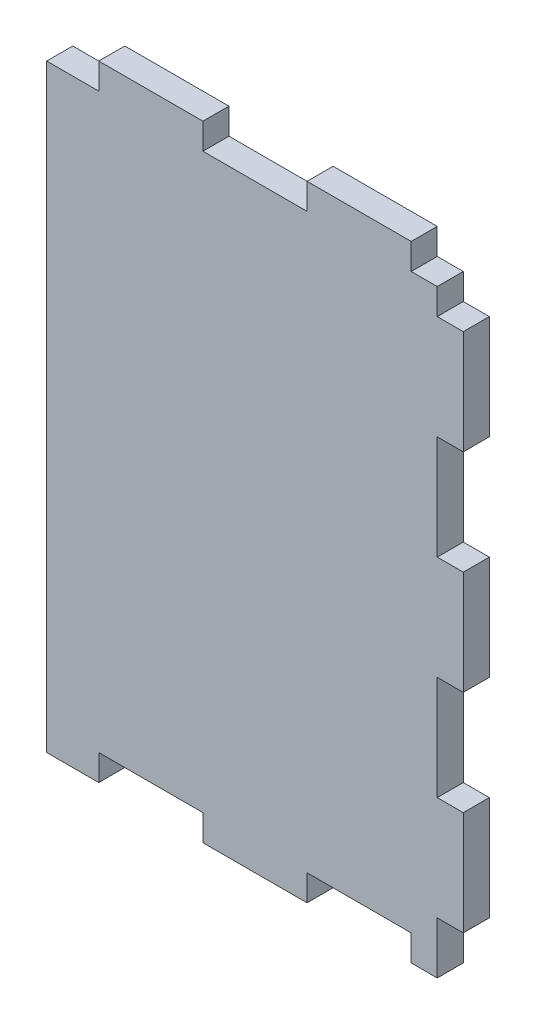
ISO-10303-21;
HEADER;
FILE_DESCRIPTION(('STEP AP214'),'2;1');
FILE_NAME('part.step','',(''),(''),'','','');
FILE_SCHEMA(('AUTOMOTIVE_DESIGN { 1 0 10303 214 1 1 1 1 }'));
ENDSEC;
DATA;
#1=APPLICATION_CONTEXT('core data for automotive mechanical design processes');
#2=APPLICATION_PROTOCOL_DEFINITION('international standard','automotive_design',2000,#1);
#3=PRODUCT_CONTEXT('',#1,'mechanical');
#4=PRODUCT('Part','Part','',(#3));
#5=PRODUCT_RELATED_PRODUCT_CATEGORY('part','',(#4));
#6=PRODUCT_DEFINITION_FORMATION('','',#4);
#7=PRODUCT_DEFINITION_CONTEXT('part definition',#1,'design');
#8=PRODUCT_DEFINITION('design','',#6,#7);
#9=PRODUCT_DEFINITION_SHAPE('','',#8);
#10=(LENGTH_UNIT() NAMED_UNIT(*) SI_UNIT(.MILLI.,.METRE.));
#11=(NAMED_UNIT(*) PLANE_ANGLE_UNIT() SI_UNIT($,.RADIAN.));
#12=(NAMED_UNIT(*) SI_UNIT($,.STERADIAN.) SOLID_ANGLE_UNIT());
#13=UNCERTAINTY_MEASURE_WITH_UNIT(LENGTH_MEASURE(1.E-05),#10,'distance_accuracy_value','');
#14=(GEOMETRIC_REPRESENTATION_CONTEXT(3) GLOBAL_UNCERTAINTY_ASSIGNED_CONTEXT((#13)) GLOBAL_UNIT_ASSIGNED_CONTEXT((#10,
#11,#12)) REPRESENTATION_CONTEXT('',''));
#15=CARTESIAN_POINT('',(0.,0.,0.));
#16=DIRECTION('',(0.,0.,1.));
#17=DIRECTION('',(1.,0.,0.));
#18=AXIS2_PLACEMENT_3D('',#15,#16,#17);
#19=CARTESIAN_POINT('',(0.,76.2,3.175));
#20=DIRECTION('',(0.,-1.,0.));
#21=DIRECTION('',(0.,0.,-1.));
#22=AXIS2_PLACEMENT_3D('',#19,#20,#21);
#23=PLANE('',#22);
#24=DIRECTION('',(-1.,0.,0.));
#25=VECTOR('',#24,1.);
#26=CARTESIAN_POINT('',(0.,76.2,3.175));
#27=LINE('',#26,#25);
#28=CARTESIAN_POINT('',(19.05,76.2,3.175));
#29=VERTEX_POINT('',#28);
#30=CARTESIAN_POINT('',(6.35,76.2,3.175));
#31=VERTEX_POINT('',#30);
#32=EDGE_CURVE('E459',#29,#31,#27,.T.);
#33=ORIENTED_EDGE('',*,*,#32,.F.);
#34=DIRECTION('',(0.,0.,1.));
#35=VECTOR('',#34,1.);
#36=CARTESIAN_POINT('',(19.05,76.2,0.));
#37=LINE('',#36,#35);
#38=CARTESIAN_POINT('',(19.05,76.2,0.));
#39=VERTEX_POINT('',#38);
#40=EDGE_CURVE('E269',#39,#29,#37,.T.);
#41=ORIENTED_EDGE('',*,*,#40,.F.);
#42=DIRECTION('',(-1.,0.,0.));
#43=VECTOR('',#42,1.);
#44=CARTESIAN_POINT('',(0.,76.2,0.));
#45=LINE('',#44,#43);
#46=CARTESIAN_POINT('',(6.35,76.2,0.));
#47=VERTEX_POINT('',#46);
#48=EDGE_CURVE('E260',#39,#47,#45,.T.);
#49=ORIENTED_EDGE('',*,*,#48,.T.);
#50=DIRECTION('',(0.,0.,1.));
#51=VECTOR('',#50,1.);
#52=CARTESIAN_POINT('',(6.35,76.2,0.));
#53=LINE('',#52,#51);
#54=EDGE_CURVE('E326',#47,#31,#53,.T.);
#55=ORIENTED_EDGE('',*,*,#54,.T.);
#56=EDGE_LOOP('',(#33,#41,#49,#55));
#57=FACE_BOUND('',#56,.T.);
#58=ADVANCED_FACE('F31',(#57),#23,.F.);
#59=CARTESIAN_POINT('',(0.,0.,3.175));
#60=DIRECTION('',(0.,1.,0.));
#61=DIRECTION('',(0.,0.,1.));
#62=AXIS2_PLACEMENT_3D('',#59,#60,#61);
#63=PLANE('',#62);
#64=DIRECTION('',(1.,0.,0.));
#65=VECTOR('',#64,1.);
#66=CARTESIAN_POINT('',(0.,0.,3.175));
#67=LINE('',#66,#65);
#68=CARTESIAN_POINT('',(44.45,0.,3.175));
#69=VERTEX_POINT('',#68);
#70=CARTESIAN_POINT('',(47.625,0.,3.175));
#71=VERTEX_POINT('',#70);
#72=EDGE_CURVE('E449',#69,#71,#67,.T.);
#73=ORIENTED_EDGE('',*,*,#72,.F.);
#74=DIRECTION('',(0.,0.,1.));
#75=VECTOR('',#74,1.);
#76=CARTESIAN_POINT('',(44.45,0.,0.));
#77=LINE('',#76,#75);
#78=CARTESIAN_POINT('',(44.45,0.,0.));
#79=VERTEX_POINT('',#78);
#80=EDGE_CURVE('E291',#79,#69,#77,.T.);
#81=ORIENTED_EDGE('',*,*,#80,.F.);
#82=DIRECTION('',(1.,0.,0.));
#83=VECTOR('',#82,1.);
#84=CARTESIAN_POINT('',(0.,0.,0.));
#85=LINE('',#84,#83);
#86=CARTESIAN_POINT('',(47.625,0.,0.));
#87=VERTEX_POINT('',#86);
#88=EDGE_CURVE('E465',#79,#87,#85,.T.);
#89=ORIENTED_EDGE('',*,*,#88,.T.);
#90=DIRECTION('',(0.,0.,1.));
#91=VECTOR('',#90,1.);
#92=CARTESIAN_POINT('',(47.625,0.,0.));
#93=LINE('',#92,#91);
#94=EDGE_CURVE('E424',#87,#71,#93,.T.);
#95=ORIENTED_EDGE('',*,*,#94,.T.);
#96=EDGE_LOOP('',(#73,#81,#89,#95));
#97=FACE_BOUND('',#96,.T.);
#98=ADVANCED_FACE('F580',(#97),#63,.F.);
#99=CARTESIAN_POINT('',(19.05,0.,0.));
#100=VERTEX_POINT('',#99);
#101=CARTESIAN_POINT('',(31.75,0.,0.));
#102=VERTEX_POINT('',#101);
#103=EDGE_CURVE('E470',#100,#102,#85,.T.);
#104=ORIENTED_EDGE('',*,*,#103,.T.);
#105=DIRECTION('',(0.,0.,1.));
#106=VECTOR('',#105,1.);
#107=CARTESIAN_POINT('',(31.75,0.,0.));
#108=LINE('',#107,#106);
#109=CARTESIAN_POINT('',(31.75,0.,3.175));
#110=VERTEX_POINT('',#109);
#111=EDGE_CURVE('E294',#102,#110,#108,.T.);
#112=ORIENTED_EDGE('',*,*,#111,.T.);
#113=CARTESIAN_POINT('',(19.05,0.,3.175));
#114=VERTEX_POINT('',#113);
#115=EDGE_CURVE('E455',#114,#110,#67,.T.);
#116=ORIENTED_EDGE('',*,*,#115,.F.);
#117=DIRECTION('',(0.,0.,1.));
#118=VECTOR('',#117,1.);
#119=CARTESIAN_POINT('',(19.05,0.,0.));
#120=LINE('',#119,#118);
#121=EDGE_CURVE('E350',#100,#114,#120,.T.);
#122=ORIENTED_EDGE('',*,*,#121,.F.);
#123=EDGE_LOOP('',(#104,#112,#116,#122));
#124=FACE_BOUND('',#123,.T.);
#125=ADVANCED_FACE('F586',(#124),#63,.F.);
#126=CARTESIAN_POINT('',(50.8,0.,3.175));
#127=DIRECTION('',(-1.,0.,0.));
#128=DIRECTION('',(0.,0.,1.));
#129=AXIS2_PLACEMENT_3D('',#126,#127,#128);
#130=PLANE('',#129);
#131=DIRECTION('',(0.,1.,0.));
#132=VECTOR('',#131,1.);
#133=CARTESIAN_POINT('',(50.8,0.,0.));
#134=LINE('',#133,#132);
#135=CARTESIAN_POINT('',(50.8,6.35000000000001,0.));
#136=VERTEX_POINT('',#135);
#137=CARTESIAN_POINT('',(50.8,19.05,0.));
#138=VERTEX_POINT('',#137);
#139=EDGE_CURVE('E471',#136,#138,#134,.T.);
#140=ORIENTED_EDGE('',*,*,#139,.T.);
#141=DIRECTION('',(0.,0.,1.));
#142=VECTOR('',#141,1.);
#143=CARTESIAN_POINT('',(50.8,19.05,0.));
#144=LINE('',#143,#142);
#145=CARTESIAN_POINT('',(50.8,19.05,3.175));
#146=VERTEX_POINT('',#145);
#147=EDGE_CURVE('E376',#138,#146,#144,.T.);
#148=ORIENTED_EDGE('',*,*,#147,.T.);
#149=DIRECTION('',(0.,1.,0.));
#150=VECTOR('',#149,1.);
#151=CARTESIAN_POINT('',(50.8,0.,3.175));
#152=LINE('',#151,#150);
#153=CARTESIAN_POINT('',(50.8,6.35000000000001,3.175));
#154=VERTEX_POINT('',#153);
#155=EDGE_CURVE('E456',#154,#146,#152,.T.);
#156=ORIENTED_EDGE('',*,*,#155,.F.);
#157=DIRECTION('',(0.,0.,1.));
#158=VECTOR('',#157,1.);
#159=CARTESIAN_POINT('',(50.8,6.35000000000001,0.));
#160=LINE('',#159,#158);
#161=EDGE_CURVE('E419',#136,#154,#160,.T.);
#162=ORIENTED_EDGE('',*,*,#161,.F.);
#163=EDGE_LOOP('',(#140,#148,#156,#162));
#164=FACE_BOUND('',#163,.T.);
#165=ADVANCED_FACE('F567',(#164),#130,.F.);
#166=CARTESIAN_POINT('',(50.8,31.75,3.175));
#167=VERTEX_POINT('',#166);
#168=CARTESIAN_POINT('',(50.8,44.45,3.175));
#169=VERTEX_POINT('',#168);
#170=EDGE_CURVE('E460',#167,#169,#152,.T.);
#171=ORIENTED_EDGE('',*,*,#170,.F.);
#172=DIRECTION('',(0.,0.,1.));
#173=VECTOR('',#172,1.);
#174=CARTESIAN_POINT('',(50.8,31.75,0.));
#175=LINE('',#174,#173);
#176=CARTESIAN_POINT('',(50.8,31.75,0.));
#177=VERTEX_POINT('',#176);
#178=EDGE_CURVE('E369',#177,#167,#175,.T.);
#179=ORIENTED_EDGE('',*,*,#178,.F.);
#180=CARTESIAN_POINT('',(50.8,44.45,0.));
#181=VERTEX_POINT('',#180);
#182=EDGE_CURVE('E474',#177,#181,#134,.T.);
#183=ORIENTED_EDGE('',*,*,#182,.T.);
#184=DIRECTION('',(0.,0.,1.));
#185=VECTOR('',#184,1.);
#186=CARTESIAN_POINT('',(50.8,44.45,0.));
#187=LINE('',#186,#185);
#188=EDGE_CURVE('E403',#181,#169,#187,.T.);
#189=ORIENTED_EDGE('',*,*,#188,.T.);
#190=EDGE_LOOP('',(#171,#179,#183,#189));
#191=FACE_BOUND('',#190,.T.);
#192=ADVANCED_FACE('F542',(#191),#130,.F.);
#193=CARTESIAN_POINT('',(0.,0.,3.175));
#194=DIRECTION('',(1.,0.,0.));
#195=DIRECTION('',(0.,0.,-1.));
#196=AXIS2_PLACEMENT_3D('',#193,#194,#195);
#197=PLANE('',#196);
#198=DIRECTION('',(0.,-1.,0.));
#199=VECTOR('',#198,1.);
#200=CARTESIAN_POINT('',(0.,0.,3.175));
#201=LINE('',#200,#199);
#202=CARTESIAN_POINT('',(0.,73.025,3.175));
#203=VERTEX_POINT('',#202);
#204=CARTESIAN_POINT('',(0.,0.,3.175));
#205=VERTEX_POINT('',#204);
#206=EDGE_CURVE('E447',#203,#205,#201,.T.);
#207=ORIENTED_EDGE('',*,*,#206,.F.);
#208=DIRECTION('',(0.,0.,1.));
#209=VECTOR('',#208,1.);
#210=CARTESIAN_POINT('',(0.,73.025,0.));
#211=LINE('',#210,#209);
#212=CARTESIAN_POINT('',(0.,73.025,0.));
#213=VERTEX_POINT('',#212);
#214=EDGE_CURVE('E321',#213,#203,#211,.T.);
#215=ORIENTED_EDGE('',*,*,#214,.F.);
#216=DIRECTION('',(0.,-1.,0.));
#217=VECTOR('',#216,1.);
#218=CARTESIAN_POINT('',(0.,0.,0.));
#219=LINE('',#218,#217);
#220=CARTESIAN_POINT('',(0.,0.,0.));
#221=VERTEX_POINT('',#220);
#222=EDGE_CURVE('E444',#213,#221,#219,.T.);
#223=ORIENTED_EDGE('',*,*,#222,.T.);
#224=DIRECTION('',(0.,0.,-1.));
#225=VECTOR('',#224,1.);
#226=CARTESIAN_POINT('',(0.,0.,3.175));
#227=LINE('',#226,#225);
#228=EDGE_CURVE('E39',#205,#221,#227,.T.);
#229=ORIENTED_EDGE('',*,*,#228,.F.);
#230=EDGE_LOOP('',(#207,#215,#223,#229));
#231=FACE_BOUND('',#230,.T.);
#232=ADVANCED_FACE('F33',(#231),#197,.F.);
#233=CARTESIAN_POINT('',(6.35,0.,0.));
#234=VERTEX_POINT('',#233);
#235=EDGE_CURVE('E466',#221,#234,#85,.T.);
#236=ORIENTED_EDGE('',*,*,#235,.T.);
#237=DIRECTION('',(0.,0.,1.));
#238=VECTOR('',#237,1.);
#239=CARTESIAN_POINT('',(6.35,0.,0.));
#240=LINE('',#239,#238);
#241=CARTESIAN_POINT('',(6.35,0.,3.175));
#242=VERTEX_POINT('',#241);
#243=EDGE_CURVE('E353',#234,#242,#240,.T.);
#244=ORIENTED_EDGE('',*,*,#243,.T.);
#245=EDGE_CURVE('E451',#205,#242,#67,.T.);
#246=ORIENTED_EDGE('',*,*,#245,.F.);
#247=ORIENTED_EDGE('',*,*,#228,.T.);
#248=EDGE_LOOP('',(#236,#244,#246,#247));
#249=FACE_BOUND('',#248,.T.);
#250=ADVANCED_FACE('F480',(#249),#63,.F.);
#251=CARTESIAN_POINT('',(50.8,57.15,3.175));
#252=VERTEX_POINT('',#251);
#253=CARTESIAN_POINT('',(50.8,69.85,3.175));
#254=VERTEX_POINT('',#253);
#255=EDGE_CURVE('E454',#252,#254,#152,.T.);
#256=ORIENTED_EDGE('',*,*,#255,.F.);
#257=DIRECTION('',(0.,0.,1.));
#258=VECTOR('',#257,1.);
#259=CARTESIAN_POINT('',(50.8,57.15,0.));
#260=LINE('',#259,#258);
#261=CARTESIAN_POINT('',(50.8,57.15,0.));
#262=VERTEX_POINT('',#261);
#263=EDGE_CURVE('E395',#262,#252,#260,.T.);
#264=ORIENTED_EDGE('',*,*,#263,.F.);
#265=CARTESIAN_POINT('',(50.8,69.85,0.));
#266=VERTEX_POINT('',#265);
#267=EDGE_CURVE('E469',#262,#266,#134,.T.);
#268=ORIENTED_EDGE('',*,*,#267,.T.);
#269=DIRECTION('',(0.,0.,1.));
#270=VECTOR('',#269,1.);
#271=CARTESIAN_POINT('',(50.8,69.85,0.));
#272=LINE('',#271,#270);
#273=EDGE_CURVE('E441',#266,#254,#272,.T.);
#274=ORIENTED_EDGE('',*,*,#273,.T.);
#275=EDGE_LOOP('',(#256,#264,#268,#274));
#276=FACE_BOUND('',#275,.T.);
#277=ADVANCED_FACE('F534',(#276),#130,.F.);
#278=CARTESIAN_POINT('',(44.45,76.2,0.));
#279=VERTEX_POINT('',#278);
#280=CARTESIAN_POINT('',(31.75,76.2,0.));
#281=VERTEX_POINT('',#280);
#282=EDGE_CURVE('E450',#279,#281,#45,.T.);
#283=ORIENTED_EDGE('',*,*,#282,.T.);
#284=DIRECTION('',(0.,0.,1.));
#285=VECTOR('',#284,1.);
#286=CARTESIAN_POINT('',(31.75,76.2,0.));
#287=LINE('',#286,#285);
#288=CARTESIAN_POINT('',(31.75,76.2,3.175));
#289=VERTEX_POINT('',#288);
#290=EDGE_CURVE('E272',#281,#289,#287,.T.);
#291=ORIENTED_EDGE('',*,*,#290,.T.);
#292=CARTESIAN_POINT('',(44.45,76.2,3.175));
#293=VERTEX_POINT('',#292);
#294=EDGE_CURVE('E461',#293,#289,#27,.T.);
#295=ORIENTED_EDGE('',*,*,#294,.F.);
#296=DIRECTION('',(0.,0.,1.));
#297=VECTOR('',#296,1.);
#298=CARTESIAN_POINT('',(44.45,76.2,0.));
#299=LINE('',#298,#297);
#300=EDGE_CURVE('E311',#279,#293,#299,.T.);
#301=ORIENTED_EDGE('',*,*,#300,.F.);
#302=EDGE_LOOP('',(#283,#291,#295,#301));
#303=FACE_BOUND('',#302,.T.);
#304=ADVANCED_FACE('F512',(#303),#23,.F.);
#305=CARTESIAN_POINT('',(0.,76.2,3.175));
#306=DIRECTION('',(0.,0.,-1.));
#307=DIRECTION('',(-1.,0.,0.));
#308=AXIS2_PLACEMENT_3D('',#305,#306,#307);
#309=PLANE('',#308);
#310=DIRECTION('',(1.,0.,0.));
#311=VECTOR('',#310,1.);
#312=CARTESIAN_POINT('',(19.05,73.025,3.175));
#313=LINE('',#312,#311);
#314=CARTESIAN_POINT('',(19.05,73.025,3.175));
#315=VERTEX_POINT('',#314);
#316=CARTESIAN_POINT('',(31.75,73.025,3.175));
#317=VERTEX_POINT('',#316);
#318=EDGE_CURVE('E263',#315,#317,#313,.T.);
#319=ORIENTED_EDGE('',*,*,#318,.F.);
#320=DIRECTION('',(0.,-1.,0.));
#321=VECTOR('',#320,1.);
#322=CARTESIAN_POINT('',(19.05,76.2,3.175));
#323=LINE('',#322,#321);
#324=EDGE_CURVE('E246',#29,#315,#323,.T.);
#325=ORIENTED_EDGE('',*,*,#324,.F.);
#326=ORIENTED_EDGE('',*,*,#32,.T.);
#327=DIRECTION('',(0.,1.,0.));
#328=VECTOR('',#327,1.);
#329=CARTESIAN_POINT('',(6.35,76.2,3.175));
#330=LINE('',#329,#328);
#331=CARTESIAN_POINT('',(6.35,73.025,3.175));
#332=VERTEX_POINT('',#331);
#333=EDGE_CURVE('E319',#332,#31,#330,.T.);
#334=ORIENTED_EDGE('',*,*,#333,.F.);
#335=DIRECTION('',(1.,0.,0.));
#336=VECTOR('',#335,1.);
#337=CARTESIAN_POINT('',(0.,73.025,3.175));
#338=LINE('',#337,#336);
#339=EDGE_CURVE('E313',#203,#332,#338,.T.);
#340=ORIENTED_EDGE('',*,*,#339,.F.);
#341=ORIENTED_EDGE('',*,*,#206,.T.);
#342=ORIENTED_EDGE('',*,*,#245,.T.);
#343=DIRECTION('',(0.,-1.,0.));
#344=VECTOR('',#343,1.);
#345=CARTESIAN_POINT('',(6.35,0.,3.175));
#346=LINE('',#345,#344);
#347=CARTESIAN_POINT('',(6.35,3.175,3.175));
#348=VERTEX_POINT('',#347);
#349=EDGE_CURVE('E337',#348,#242,#346,.T.);
#350=ORIENTED_EDGE('',*,*,#349,.F.);
#351=DIRECTION('',(-1.,0.,0.));
#352=VECTOR('',#351,1.);
#353=CARTESIAN_POINT('',(19.05,3.175,3.175));
#354=LINE('',#353,#352);
#355=CARTESIAN_POINT('',(19.05,3.175,3.175));
#356=VERTEX_POINT('',#355);
#357=EDGE_CURVE('E346',#356,#348,#354,.T.);
#358=ORIENTED_EDGE('',*,*,#357,.F.);
#359=DIRECTION('',(0.,1.,0.));
#360=VECTOR('',#359,1.);
#361=CARTESIAN_POINT('',(19.05,0.,3.175));
#362=LINE('',#361,#360);
#363=EDGE_CURVE('E329',#114,#356,#362,.T.);
#364=ORIENTED_EDGE('',*,*,#363,.F.);
#365=ORIENTED_EDGE('',*,*,#115,.T.);
#366=DIRECTION('',(0.,-1.,0.));
#367=VECTOR('',#366,1.);
#368=CARTESIAN_POINT('',(31.75,0.,3.175));
#369=LINE('',#368,#367);
#370=CARTESIAN_POINT('',(31.75,3.17500000000002,3.175));
#371=VERTEX_POINT('',#370);
#372=EDGE_CURVE('E280',#371,#110,#369,.T.);
#373=ORIENTED_EDGE('',*,*,#372,.F.);
#374=DIRECTION('',(-1.,0.,0.));
#375=VECTOR('',#374,1.);
#376=CARTESIAN_POINT('',(44.45,3.17500000000002,3.175));
#377=LINE('',#376,#375);
#378=CARTESIAN_POINT('',(44.45,3.17500000000002,3.175));
#379=VERTEX_POINT('',#378);
#380=EDGE_CURVE('E287',#379,#371,#377,.T.);
#381=ORIENTED_EDGE('',*,*,#380,.F.);
#382=DIRECTION('',(0.,1.,0.));
#383=VECTOR('',#382,1.);
#384=CARTESIAN_POINT('',(44.45,0.,3.175));
#385=LINE('',#384,#383);
#386=EDGE_CURVE('E271',#69,#379,#385,.T.);
#387=ORIENTED_EDGE('',*,*,#386,.F.);
#388=ORIENTED_EDGE('',*,*,#72,.T.);
#389=DIRECTION('',(0.,-1.,0.));
#390=VECTOR('',#389,1.);
#391=CARTESIAN_POINT('',(47.625,0.,3.175));
#392=LINE('',#391,#390);
#393=CARTESIAN_POINT('',(47.625,6.35000000000001,3.175));
#394=VERTEX_POINT('',#393);
#395=EDGE_CURVE('E416',#394,#71,#392,.T.);
#396=ORIENTED_EDGE('',*,*,#395,.F.);
#397=DIRECTION('',(-1.,0.,0.));
#398=VECTOR('',#397,1.);
#399=CARTESIAN_POINT('',(50.8,6.35000000000001,3.175));
#400=LINE('',#399,#398);
#401=EDGE_CURVE('E406',#154,#394,#400,.T.);
#402=ORIENTED_EDGE('',*,*,#401,.F.);
#403=ORIENTED_EDGE('',*,*,#155,.T.);
#404=DIRECTION('',(1.,0.,0.));
#405=VECTOR('',#404,1.);
#406=CARTESIAN_POINT('',(50.8,19.05,3.175));
#407=LINE('',#406,#405);
#408=CARTESIAN_POINT('',(47.625,19.05,3.175));
#409=VERTEX_POINT('',#408);
#410=EDGE_CURVE('E363',#409,#146,#407,.T.);
#411=ORIENTED_EDGE('',*,*,#410,.F.);
#412=DIRECTION('',(0.,-1.,0.));
#413=VECTOR('',#412,1.);
#414=CARTESIAN_POINT('',(47.625,31.75,3.175));
#415=LINE('',#414,#413);
#416=CARTESIAN_POINT('',(47.625,31.75,3.175));
#417=VERTEX_POINT('',#416);
#418=EDGE_CURVE('E372',#417,#409,#415,.T.);
#419=ORIENTED_EDGE('',*,*,#418,.F.);
#420=DIRECTION('',(-1.,0.,0.));
#421=VECTOR('',#420,1.);
#422=CARTESIAN_POINT('',(50.8,31.75,3.175));
#423=LINE('',#422,#421);
#424=EDGE_CURVE('E352',#167,#417,#423,.T.);
#425=ORIENTED_EDGE('',*,*,#424,.F.);
#426=ORIENTED_EDGE('',*,*,#170,.T.);
#427=DIRECTION('',(1.,0.,0.));
#428=VECTOR('',#427,1.);
#429=CARTESIAN_POINT('',(50.8,44.45,3.175));
#430=LINE('',#429,#428);
#431=CARTESIAN_POINT('',(47.625,44.45,3.175));
#432=VERTEX_POINT('',#431);
#433=EDGE_CURVE('E389',#432,#169,#430,.T.);
#434=ORIENTED_EDGE('',*,*,#433,.F.);
#435=DIRECTION('',(0.,-1.,0.));
#436=VECTOR('',#435,1.);
#437=CARTESIAN_POINT('',(47.625,57.15,3.175));
#438=LINE('',#437,#436);
#439=CARTESIAN_POINT('',(47.625,57.15,3.175));
#440=VERTEX_POINT('',#439);
#441=EDGE_CURVE('E398',#440,#432,#438,.T.);
#442=ORIENTED_EDGE('',*,*,#441,.F.);
#443=DIRECTION('',(-1.,0.,0.));
#444=VECTOR('',#443,1.);
#445=CARTESIAN_POINT('',(50.8,57.15,3.175));
#446=LINE('',#445,#444);
#447=EDGE_CURVE('E379',#252,#440,#446,.T.);
#448=ORIENTED_EDGE('',*,*,#447,.F.);
#449=ORIENTED_EDGE('',*,*,#255,.T.);
#450=DIRECTION('',(1.,0.,0.));
#451=VECTOR('',#450,1.);
#452=CARTESIAN_POINT('',(50.8,69.85,3.175));
#453=LINE('',#452,#451);
#454=CARTESIAN_POINT('',(47.625,69.85,3.175));
#455=VERTEX_POINT('',#454);
#456=EDGE_CURVE('E434',#455,#254,#453,.T.);
#457=ORIENTED_EDGE('',*,*,#456,.F.);
#458=DIRECTION('',(0.,-1.,0.));
#459=VECTOR('',#458,1.);
#460=CARTESIAN_POINT('',(47.625,69.85,3.175));
#461=LINE('',#460,#459);
#462=CARTESIAN_POINT('',(47.625,73.025,3.175));
#463=VERTEX_POINT('',#462);
#464=EDGE_CURVE('E427',#463,#455,#461,.T.);
#465=ORIENTED_EDGE('',*,*,#464,.F.);
#466=DIRECTION('',(1.,0.,0.));
#467=VECTOR('',#466,1.);
#468=CARTESIAN_POINT('',(44.45,73.025,3.175));
#469=LINE('',#468,#467);
#470=CARTESIAN_POINT('',(44.45,73.025,3.175));
#471=VERTEX_POINT('',#470);
#472=EDGE_CURVE('E304',#471,#463,#469,.T.);
#473=ORIENTED_EDGE('',*,*,#472,.F.);
#474=DIRECTION('',(0.,-1.,0.));
#475=VECTOR('',#474,1.);
#476=CARTESIAN_POINT('',(44.45,76.2,3.175));
#477=LINE('',#476,#475);
#478=EDGE_CURVE('E293',#293,#471,#477,.T.);
#479=ORIENTED_EDGE('',*,*,#478,.F.);
#480=ORIENTED_EDGE('',*,*,#294,.T.);
#481=DIRECTION('',(0.,1.,0.));
#482=VECTOR('',#481,1.);
#483=CARTESIAN_POINT('',(31.75,76.2,3.175));
#484=LINE('',#483,#482);
#485=EDGE_CURVE('E261',#317,#289,#484,.T.);
#486=ORIENTED_EDGE('',*,*,#485,.F.);
#487=EDGE_LOOP('',(#319,#325,#326,#334,#340,#341,#342,#350,#358,#364,#365,#373,#381,#387,#388,
#396,#402,#403,#411,#419,#425,#426,#434,#442,#448,#449,#457,#465,#473,#479,#480,#486));
#488=FACE_BOUND('',#487,.T.);
#489=ADVANCED_FACE('F496',(#488),#309,.F.);
#490=CARTESIAN_POINT('',(0.,76.2,0.));
#491=DIRECTION('',(0.,0.,-1.));
#492=DIRECTION('',(-1.,0.,0.));
#493=AXIS2_PLACEMENT_3D('',#490,#491,#492);
#494=PLANE('',#493);
#495=DIRECTION('',(0.,-1.,0.));
#496=VECTOR('',#495,1.);
#497=CARTESIAN_POINT('',(19.05,76.2,0.));
#498=LINE('',#497,#496);
#499=CARTESIAN_POINT('',(19.05,73.025,0.));
#500=VERTEX_POINT('',#499);
#501=EDGE_CURVE('E243',#39,#500,#498,.T.);
#502=ORIENTED_EDGE('',*,*,#501,.T.);
#503=DIRECTION('',(1.,0.,0.));
#504=VECTOR('',#503,1.);
#505=CARTESIAN_POINT('',(19.05,73.025,0.));
#506=LINE('',#505,#504);
#507=CARTESIAN_POINT('',(31.75,73.025,0.));
#508=VERTEX_POINT('',#507);
#509=EDGE_CURVE('E253',#500,#508,#506,.T.);
#510=ORIENTED_EDGE('',*,*,#509,.T.);
#511=DIRECTION('',(0.,1.,0.));
#512=VECTOR('',#511,1.);
#513=CARTESIAN_POINT('',(31.75,76.2,0.));
#514=LINE('',#513,#512);
#515=EDGE_CURVE('E46',#508,#281,#514,.T.);
#516=ORIENTED_EDGE('',*,*,#515,.T.);
#517=ORIENTED_EDGE('',*,*,#282,.F.);
#518=DIRECTION('',(0.,-1.,0.));
#519=VECTOR('',#518,1.);
#520=CARTESIAN_POINT('',(44.45,76.2,0.));
#521=LINE('',#520,#519);
#522=CARTESIAN_POINT('',(44.45,73.025,0.));
#523=VERTEX_POINT('',#522);
#524=EDGE_CURVE('E300',#279,#523,#521,.T.);
#525=ORIENTED_EDGE('',*,*,#524,.T.);
#526=DIRECTION('',(1.,0.,0.));
#527=VECTOR('',#526,1.);
#528=CARTESIAN_POINT('',(44.45,73.025,0.));
#529=LINE('',#528,#527);
#530=CARTESIAN_POINT('',(47.625,73.025,0.));
#531=VERTEX_POINT('',#530);
#532=EDGE_CURVE('E303',#523,#531,#529,.T.);
#533=ORIENTED_EDGE('',*,*,#532,.T.);
#534=DIRECTION('',(0.,-1.,0.));
#535=VECTOR('',#534,1.);
#536=CARTESIAN_POINT('',(47.625,69.85,0.));
#537=LINE('',#536,#535);
#538=CARTESIAN_POINT('',(47.625,69.85,0.));
#539=VERTEX_POINT('',#538);
#540=EDGE_CURVE('E431',#531,#539,#537,.T.);
#541=ORIENTED_EDGE('',*,*,#540,.T.);
#542=DIRECTION('',(1.,0.,0.));
#543=VECTOR('',#542,1.);
#544=CARTESIAN_POINT('',(50.8,69.85,0.));
#545=LINE('',#544,#543);
#546=EDGE_CURVE('E433',#539,#266,#545,.T.);
#547=ORIENTED_EDGE('',*,*,#546,.T.);
#548=ORIENTED_EDGE('',*,*,#267,.F.);
#549=DIRECTION('',(-1.,0.,0.));
#550=VECTOR('',#549,1.);
#551=CARTESIAN_POINT('',(50.8,57.15,0.));
#552=LINE('',#551,#550);
#553=CARTESIAN_POINT('',(47.625,57.15,0.));
#554=VERTEX_POINT('',#553);
#555=EDGE_CURVE('E385',#262,#554,#552,.T.);
#556=ORIENTED_EDGE('',*,*,#555,.T.);
#557=DIRECTION('',(0.,-1.,0.));
#558=VECTOR('',#557,1.);
#559=CARTESIAN_POINT('',(47.625,57.15,0.));
#560=LINE('',#559,#558);
#561=CARTESIAN_POINT('',(47.625,44.45,0.));
#562=VERTEX_POINT('',#561);
#563=EDGE_CURVE('E388',#554,#562,#560,.T.);
#564=ORIENTED_EDGE('',*,*,#563,.T.);
#565=DIRECTION('',(1.,0.,0.));
#566=VECTOR('',#565,1.);
#567=CARTESIAN_POINT('',(50.8,44.45,0.));
#568=LINE('',#567,#566);
#569=EDGE_CURVE('E392',#562,#181,#568,.T.);
#570=ORIENTED_EDGE('',*,*,#569,.T.);
#571=ORIENTED_EDGE('',*,*,#182,.F.);
#572=DIRECTION('',(-1.,0.,0.));
#573=VECTOR('',#572,1.);
#574=CARTESIAN_POINT('',(50.8,31.75,0.));
#575=LINE('',#574,#573);
#576=CARTESIAN_POINT('',(47.625,31.75,0.));
#577=VERTEX_POINT('',#576);
#578=EDGE_CURVE('E359',#177,#577,#575,.T.);
#579=ORIENTED_EDGE('',*,*,#578,.T.);
#580=DIRECTION('',(0.,-1.,0.));
#581=VECTOR('',#580,1.);
#582=CARTESIAN_POINT('',(47.625,31.75,0.));
#583=LINE('',#582,#581);
#584=CARTESIAN_POINT('',(47.625,19.05,0.));
#585=VERTEX_POINT('',#584);
#586=EDGE_CURVE('E362',#577,#585,#583,.T.);
#587=ORIENTED_EDGE('',*,*,#586,.T.);
#588=DIRECTION('',(1.,0.,0.));
#589=VECTOR('',#588,1.);
#590=CARTESIAN_POINT('',(50.8,19.05,0.));
#591=LINE('',#590,#589);
#592=EDGE_CURVE('E366',#585,#138,#591,.T.);
#593=ORIENTED_EDGE('',*,*,#592,.T.);
#594=ORIENTED_EDGE('',*,*,#139,.F.);
#595=DIRECTION('',(-1.,0.,0.));
#596=VECTOR('',#595,1.);
#597=CARTESIAN_POINT('',(50.8,6.35000000000001,0.));
#598=LINE('',#597,#596);
#599=CARTESIAN_POINT('',(47.625,6.35000000000001,0.));
#600=VERTEX_POINT('',#599);
#601=EDGE_CURVE('E412',#136,#600,#598,.T.);
#602=ORIENTED_EDGE('',*,*,#601,.T.);
#603=DIRECTION('',(0.,-1.,0.));
#604=VECTOR('',#603,1.);
#605=CARTESIAN_POINT('',(47.625,0.,0.));
#606=LINE('',#605,#604);
#607=EDGE_CURVE('E415',#600,#87,#606,.T.);
#608=ORIENTED_EDGE('',*,*,#607,.T.);
#609=ORIENTED_EDGE('',*,*,#88,.F.);
#610=DIRECTION('',(0.,1.,0.));
#611=VECTOR('',#610,1.);
#612=CARTESIAN_POINT('',(44.45,0.,0.));
#613=LINE('',#612,#611);
#614=CARTESIAN_POINT('',(44.45,3.17500000000002,0.));
#615=VERTEX_POINT('',#614);
#616=EDGE_CURVE('E276',#79,#615,#613,.T.);
#617=ORIENTED_EDGE('',*,*,#616,.T.);
#618=DIRECTION('',(-1.,0.,0.));
#619=VECTOR('',#618,1.);
#620=CARTESIAN_POINT('',(44.45,3.17500000000002,0.));
#621=LINE('',#620,#619);
#622=CARTESIAN_POINT('',(31.75,3.17500000000003,0.));
#623=VERTEX_POINT('',#622);
#624=EDGE_CURVE('E279',#615,#623,#621,.T.);
#625=ORIENTED_EDGE('',*,*,#624,.T.);
#626=DIRECTION('',(0.,-1.,0.));
#627=VECTOR('',#626,1.);
#628=CARTESIAN_POINT('',(31.75,0.,0.));
#629=LINE('',#628,#627);
#630=EDGE_CURVE('E54',#623,#102,#629,.T.);
#631=ORIENTED_EDGE('',*,*,#630,.T.);
#632=ORIENTED_EDGE('',*,*,#103,.F.);
#633=DIRECTION('',(0.,1.,0.));
#634=VECTOR('',#633,1.);
#635=CARTESIAN_POINT('',(19.05,0.,0.));
#636=LINE('',#635,#634);
#637=CARTESIAN_POINT('',(19.05,3.175,0.));
#638=VERTEX_POINT('',#637);
#639=EDGE_CURVE('E333',#100,#638,#636,.T.);
#640=ORIENTED_EDGE('',*,*,#639,.T.);
#641=DIRECTION('',(-1.,0.,0.));
#642=VECTOR('',#641,1.);
#643=CARTESIAN_POINT('',(19.05,3.175,0.));
#644=LINE('',#643,#642);
#645=CARTESIAN_POINT('',(6.35,3.175,0.));
#646=VERTEX_POINT('',#645);
#647=EDGE_CURVE('E336',#638,#646,#644,.T.);
#648=ORIENTED_EDGE('',*,*,#647,.T.);
#649=DIRECTION('',(0.,-1.,0.));
#650=VECTOR('',#649,1.);
#651=CARTESIAN_POINT('',(6.35,0.,0.));
#652=LINE('',#651,#650);
#653=EDGE_CURVE('E340',#646,#234,#652,.T.);
#654=ORIENTED_EDGE('',*,*,#653,.T.);
#655=ORIENTED_EDGE('',*,*,#235,.F.);
#656=ORIENTED_EDGE('',*,*,#222,.F.);
#657=DIRECTION('',(1.,0.,0.));
#658=VECTOR('',#657,1.);
#659=CARTESIAN_POINT('',(0.,73.025,0.));
#660=LINE('',#659,#658);
#661=CARTESIAN_POINT('',(6.35,73.025,0.));
#662=VERTEX_POINT('',#661);
#663=EDGE_CURVE('E315',#213,#662,#660,.T.);
#664=ORIENTED_EDGE('',*,*,#663,.T.);
#665=DIRECTION('',(0.,1.,0.));
#666=VECTOR('',#665,1.);
#667=CARTESIAN_POINT('',(6.35,76.2,0.));
#668=LINE('',#667,#666);
#669=EDGE_CURVE('E318',#662,#47,#668,.T.);
#670=ORIENTED_EDGE('',*,*,#669,.T.);
#671=ORIENTED_EDGE('',*,*,#48,.F.);
#672=EDGE_LOOP('',(#502,#510,#516,#517,#525,#533,#541,#547,#548,#556,#564,#570,#571,#579,#587,
#593,#594,#602,#608,#609,#617,#625,#631,#632,#640,#648,#654,#655,#656,#664,#670,#671));
#673=FACE_BOUND('',#672,.T.);
#674=ADVANCED_FACE('F258',(#673),#494,.T.);
#675=CARTESIAN_POINT('',(50.8,69.85,0.));
#676=DIRECTION('',(0.,-1.,0.));
#677=DIRECTION('',(1.,0.,0.));
#678=AXIS2_PLACEMENT_3D('',#675,#676,#677);
#679=PLANE('',#678);
#680=ORIENTED_EDGE('',*,*,#456,.T.);
#681=ORIENTED_EDGE('',*,*,#273,.F.);
#682=ORIENTED_EDGE('',*,*,#546,.F.);
#683=DIRECTION('',(0.,0.,1.));
#684=VECTOR('',#683,1.);
#685=CARTESIAN_POINT('',(47.625,69.85,0.));
#686=LINE('',#685,#684);
#687=EDGE_CURVE('E437',#539,#455,#686,.T.);
#688=ORIENTED_EDGE('',*,*,#687,.T.);
#689=EDGE_LOOP('',(#680,#681,#682,#688));
#690=FACE_BOUND('',#689,.T.);
#691=ADVANCED_FACE('F531',(#690),#679,.F.);
#692=CARTESIAN_POINT('',(47.625,69.85,0.));
#693=DIRECTION('',(-1.,0.,0.));
#694=DIRECTION('',(0.,0.,1.));
#695=AXIS2_PLACEMENT_3D('',#692,#693,#694);
#696=PLANE('',#695);
#697=ORIENTED_EDGE('',*,*,#540,.F.);
#698=DIRECTION('',(0.,0.,1.));
#699=VECTOR('',#698,1.);
#700=CARTESIAN_POINT('',(47.625,73.025,0.));
#701=LINE('',#700,#699);
#702=EDGE_CURVE('E11',#531,#463,#701,.T.);
#703=ORIENTED_EDGE('',*,*,#702,.T.);
#704=ORIENTED_EDGE('',*,*,#464,.T.);
#705=ORIENTED_EDGE('',*,*,#687,.F.);
#706=EDGE_LOOP('',(#697,#703,#704,#705));
#707=FACE_BOUND('',#706,.T.);
#708=ADVANCED_FACE('F524',(#707),#696,.F.);
#709=CARTESIAN_POINT('',(47.625,0.,0.));
#710=DIRECTION('',(-1.,0.,0.));
#711=DIRECTION('',(0.,0.,1.));
#712=AXIS2_PLACEMENT_3D('',#709,#710,#711);
#713=PLANE('',#712);
#714=ORIENTED_EDGE('',*,*,#395,.T.);
#715=ORIENTED_EDGE('',*,*,#94,.F.);
#716=ORIENTED_EDGE('',*,*,#607,.F.);
#717=DIRECTION('',(0.,0.,1.));
#718=VECTOR('',#717,1.);
#719=CARTESIAN_POINT('',(47.625,6.35000000000001,0.));
#720=LINE('',#719,#718);
#721=EDGE_CURVE('E428',#600,#394,#720,.T.);
#722=ORIENTED_EDGE('',*,*,#721,.T.);
#723=EDGE_LOOP('',(#714,#715,#716,#722));
#724=FACE_BOUND('',#723,.T.);
#725=ADVANCED_FACE('F577',(#724),#713,.F.);
#726=CARTESIAN_POINT('',(50.8,6.35000000000001,0.));
#727=DIRECTION('',(0.,1.,0.));
#728=DIRECTION('',(0.,0.,1.));
#729=AXIS2_PLACEMENT_3D('',#726,#727,#728);
#730=PLANE('',#729);
#731=ORIENTED_EDGE('',*,*,#401,.T.);
#732=ORIENTED_EDGE('',*,*,#721,.F.);
#733=ORIENTED_EDGE('',*,*,#601,.F.);
#734=ORIENTED_EDGE('',*,*,#161,.T.);
#735=EDGE_LOOP('',(#731,#732,#733,#734));
#736=FACE_BOUND('',#735,.T.);
#737=ADVANCED_FACE('F573',(#736),#730,.F.);
#738=CARTESIAN_POINT('',(50.8,44.45,0.));
#739=DIRECTION('',(0.,-1.,0.));
#740=DIRECTION('',(0.,0.,-1.));
#741=AXIS2_PLACEMENT_3D('',#738,#739,#740);
#742=PLANE('',#741);
#743=ORIENTED_EDGE('',*,*,#433,.T.);
#744=ORIENTED_EDGE('',*,*,#188,.F.);
#745=ORIENTED_EDGE('',*,*,#569,.F.);
#746=DIRECTION('',(0.,0.,1.));
#747=VECTOR('',#746,1.);
#748=CARTESIAN_POINT('',(47.625,44.45,0.));
#749=LINE('',#748,#747);
#750=EDGE_CURVE('E407',#562,#432,#749,.T.);
#751=ORIENTED_EDGE('',*,*,#750,.T.);
#752=EDGE_LOOP('',(#743,#744,#745,#751));
#753=FACE_BOUND('',#752,.T.);
#754=ADVANCED_FACE('F545',(#753),#742,.F.);
#755=CARTESIAN_POINT('',(47.625,57.15,0.));
#756=DIRECTION('',(-1.,0.,0.));
#757=DIRECTION('',(0.,-1.,0.));
#758=AXIS2_PLACEMENT_3D('',#755,#756,#757);
#759=PLANE('',#758);
#760=ORIENTED_EDGE('',*,*,#441,.T.);
#761=ORIENTED_EDGE('',*,*,#750,.F.);
#762=ORIENTED_EDGE('',*,*,#563,.F.);
#763=DIRECTION('',(0.,0.,1.));
#764=VECTOR('',#763,1.);
#765=CARTESIAN_POINT('',(47.625,57.15,0.));
#766=LINE('',#765,#764);
#767=EDGE_CURVE('E409',#554,#440,#766,.T.);
#768=ORIENTED_EDGE('',*,*,#767,.T.);
#769=EDGE_LOOP('',(#760,#761,#762,#768));
#770=FACE_BOUND('',#769,.T.);
#771=ADVANCED_FACE('F549',(#770),#759,.F.);
#772=CARTESIAN_POINT('',(50.8,57.15,0.));
#773=DIRECTION('',(0.,1.,0.));
#774=DIRECTION('',(0.,0.,1.));
#775=AXIS2_PLACEMENT_3D('',#772,#773,#774);
#776=PLANE('',#775);
#777=ORIENTED_EDGE('',*,*,#447,.T.);
#778=ORIENTED_EDGE('',*,*,#767,.F.);
#779=ORIENTED_EDGE('',*,*,#555,.F.);
#780=ORIENTED_EDGE('',*,*,#263,.T.);
#781=EDGE_LOOP('',(#777,#778,#779,#780));
#782=FACE_BOUND('',#781,.T.);
#783=ADVANCED_FACE('F551',(#782),#776,.F.);
#784=CARTESIAN_POINT('',(50.8,19.05,0.));
#785=DIRECTION('',(0.,-1.,0.));
#786=DIRECTION('',(0.,0.,-1.));
#787=AXIS2_PLACEMENT_3D('',#784,#785,#786);
#788=PLANE('',#787);
#789=ORIENTED_EDGE('',*,*,#410,.T.);
#790=ORIENTED_EDGE('',*,*,#147,.F.);
#791=ORIENTED_EDGE('',*,*,#592,.F.);
#792=DIRECTION('',(0.,0.,1.));
#793=VECTOR('',#792,1.);
#794=CARTESIAN_POINT('',(47.625,19.05,0.));
#795=LINE('',#794,#793);
#796=EDGE_CURVE('E380',#585,#409,#795,.T.);
#797=ORIENTED_EDGE('',*,*,#796,.T.);
#798=EDGE_LOOP('',(#789,#790,#791,#797));
#799=FACE_BOUND('',#798,.T.);
#800=ADVANCED_FACE('F564',(#799),#788,.F.);
#801=CARTESIAN_POINT('',(47.625,31.75,0.));
#802=DIRECTION('',(-1.,0.,0.));
#803=DIRECTION('',(0.,-1.,0.));
#804=AXIS2_PLACEMENT_3D('',#801,#802,#803);
#805=PLANE('',#804);
#806=ORIENTED_EDGE('',*,*,#418,.T.);
#807=ORIENTED_EDGE('',*,*,#796,.F.);
#808=ORIENTED_EDGE('',*,*,#586,.F.);
#809=DIRECTION('',(0.,0.,1.));
#810=VECTOR('',#809,1.);
#811=CARTESIAN_POINT('',(47.625,31.75,0.));
#812=LINE('',#811,#810);
#813=EDGE_CURVE('E382',#577,#417,#812,.T.);
#814=ORIENTED_EDGE('',*,*,#813,.T.);
#815=EDGE_LOOP('',(#806,#807,#808,#814));
#816=FACE_BOUND('',#815,.T.);
#817=ADVANCED_FACE('F562',(#816),#805,.F.);
#818=CARTESIAN_POINT('',(50.8,31.75,0.));
#819=DIRECTION('',(0.,1.,0.));
#820=DIRECTION('',(0.,0.,1.));
#821=AXIS2_PLACEMENT_3D('',#818,#819,#820);
#822=PLANE('',#821);
#823=ORIENTED_EDGE('',*,*,#424,.T.);
#824=ORIENTED_EDGE('',*,*,#813,.F.);
#825=ORIENTED_EDGE('',*,*,#578,.F.);
#826=ORIENTED_EDGE('',*,*,#178,.T.);
#827=EDGE_LOOP('',(#823,#824,#825,#826));
#828=FACE_BOUND('',#827,.T.);
#829=ADVANCED_FACE('F558',(#828),#822,.F.);
#830=CARTESIAN_POINT('',(19.05,0.,0.));
#831=DIRECTION('',(1.,0.,0.));
#832=DIRECTION('',(0.,0.,-1.));
#833=AXIS2_PLACEMENT_3D('',#830,#831,#832);
#834=PLANE('',#833);
#835=ORIENTED_EDGE('',*,*,#363,.T.);
#836=DIRECTION('',(0.,0.,1.));
#837=VECTOR('',#836,1.);
#838=CARTESIAN_POINT('',(19.05,3.175,0.));
#839=LINE('',#838,#837);
#840=EDGE_CURVE('E343',#638,#356,#839,.T.);
#841=ORIENTED_EDGE('',*,*,#840,.F.);
#842=ORIENTED_EDGE('',*,*,#639,.F.);
#843=ORIENTED_EDGE('',*,*,#121,.T.);
#844=EDGE_LOOP('',(#835,#841,#842,#843));
#845=FACE_BOUND('',#844,.T.);
#846=ADVANCED_FACE('F648',(#845),#834,.F.);
#847=CARTESIAN_POINT('',(6.35,0.,0.));
#848=DIRECTION('',(-1.,0.,0.));
#849=DIRECTION('',(0.,0.,1.));
#850=AXIS2_PLACEMENT_3D('',#847,#848,#849);
#851=PLANE('',#850);
#852=ORIENTED_EDGE('',*,*,#349,.T.);
#853=ORIENTED_EDGE('',*,*,#243,.F.);
#854=ORIENTED_EDGE('',*,*,#653,.F.);
#855=DIRECTION('',(0.,0.,1.));
#856=VECTOR('',#855,1.);
#857=CARTESIAN_POINT('',(6.35,3.175,0.));
#858=LINE('',#857,#856);
#859=EDGE_CURVE('E356',#646,#348,#858,.T.);
#860=ORIENTED_EDGE('',*,*,#859,.T.);
#861=EDGE_LOOP('',(#852,#853,#854,#860));
#862=FACE_BOUND('',#861,.T.);
#863=ADVANCED_FACE('F489',(#862),#851,.F.);
#864=CARTESIAN_POINT('',(19.05,3.175,0.));
#865=DIRECTION('',(0.,1.,0.));
#866=DIRECTION('',(-1.,0.,0.));
#867=AXIS2_PLACEMENT_3D('',#864,#865,#866);
#868=PLANE('',#867);
#869=ORIENTED_EDGE('',*,*,#357,.T.);
#870=ORIENTED_EDGE('',*,*,#859,.F.);
#871=ORIENTED_EDGE('',*,*,#647,.F.);
#872=ORIENTED_EDGE('',*,*,#840,.T.);
#873=EDGE_LOOP('',(#869,#870,#871,#872));
#874=FACE_BOUND('',#873,.T.);
#875=ADVANCED_FACE('F491',(#874),#868,.F.);
#876=CARTESIAN_POINT('',(6.35,76.2,0.));
#877=DIRECTION('',(1.,0.,0.));
#878=DIRECTION('',(0.,1.,0.));
#879=AXIS2_PLACEMENT_3D('',#876,#877,#878);
#880=PLANE('',#879);
#881=ORIENTED_EDGE('',*,*,#333,.T.);
#882=ORIENTED_EDGE('',*,*,#54,.F.);
#883=ORIENTED_EDGE('',*,*,#669,.F.);
#884=DIRECTION('',(0.,0.,1.));
#885=VECTOR('',#884,1.);
#886=CARTESIAN_POINT('',(6.35,73.025,0.));
#887=LINE('',#886,#885);
#888=EDGE_CURVE('E330',#662,#332,#887,.T.);
#889=ORIENTED_EDGE('',*,*,#888,.T.);
#890=EDGE_LOOP('',(#881,#882,#883,#889));
#891=FACE_BOUND('',#890,.T.);
#892=ADVANCED_FACE('F504',(#891),#880,.F.);
#893=CARTESIAN_POINT('',(0.,73.025,0.));
#894=DIRECTION('',(0.,-1.,0.));
#895=DIRECTION('',(0.,0.,-1.));
#896=AXIS2_PLACEMENT_3D('',#893,#894,#895);
#897=PLANE('',#896);
#898=ORIENTED_EDGE('',*,*,#339,.T.);
#899=ORIENTED_EDGE('',*,*,#888,.F.);
#900=ORIENTED_EDGE('',*,*,#663,.F.);
#901=ORIENTED_EDGE('',*,*,#214,.T.);
#902=EDGE_LOOP('',(#898,#899,#900,#901));
#903=FACE_BOUND('',#902,.T.);
#904=ADVANCED_FACE('F501',(#903),#897,.F.);
#905=CARTESIAN_POINT('',(44.45,73.025,0.));
#906=DIRECTION('',(0.,-1.,0.));
#907=DIRECTION('',(0.,0.,-1.));
#908=AXIS2_PLACEMENT_3D('',#905,#906,#907);
#909=PLANE('',#908);
#910=ORIENTED_EDGE('',*,*,#532,.F.);
#911=DIRECTION('',(0.,0.,1.));
#912=VECTOR('',#911,1.);
#913=CARTESIAN_POINT('',(44.45,73.025,0.));
#914=LINE('',#913,#912);
#915=EDGE_CURVE('E307',#523,#471,#914,.T.);
#916=ORIENTED_EDGE('',*,*,#915,.T.);
#917=ORIENTED_EDGE('',*,*,#472,.T.);
#918=ORIENTED_EDGE('',*,*,#702,.F.);
#919=EDGE_LOOP('',(#910,#916,#917,#918));
#920=FACE_BOUND('',#919,.T.);
#921=ADVANCED_FACE('F521',(#920),#909,.F.);
#922=CARTESIAN_POINT('',(44.45,76.2,0.));
#923=DIRECTION('',(-1.,0.,0.));
#924=DIRECTION('',(0.,-1.,0.));
#925=AXIS2_PLACEMENT_3D('',#922,#923,#924);
#926=PLANE('',#925);
#927=ORIENTED_EDGE('',*,*,#478,.T.);
#928=ORIENTED_EDGE('',*,*,#915,.F.);
#929=ORIENTED_EDGE('',*,*,#524,.F.);
#930=ORIENTED_EDGE('',*,*,#300,.T.);
#931=EDGE_LOOP('',(#927,#928,#929,#930));
#932=FACE_BOUND('',#931,.T.);
#933=ADVANCED_FACE('F518',(#932),#926,.F.);
#934=CARTESIAN_POINT('',(44.45,0.,0.));
#935=DIRECTION('',(1.,0.,0.));
#936=DIRECTION('',(0.,0.,-1.));
#937=AXIS2_PLACEMENT_3D('',#934,#935,#936);
#938=PLANE('',#937);
#939=ORIENTED_EDGE('',*,*,#386,.T.);
#940=DIRECTION('',(0.,0.,1.));
#941=VECTOR('',#940,1.);
#942=CARTESIAN_POINT('',(44.45,3.17500000000002,0.));
#943=LINE('',#942,#941);
#944=EDGE_CURVE('E284',#615,#379,#943,.T.);
#945=ORIENTED_EDGE('',*,*,#944,.F.);
#946=ORIENTED_EDGE('',*,*,#616,.F.);
#947=ORIENTED_EDGE('',*,*,#80,.T.);
#948=EDGE_LOOP('',(#939,#945,#946,#947));
#949=FACE_BOUND('',#948,.T.);
#950=ADVANCED_FACE('F597',(#949),#938,.F.);
#951=CARTESIAN_POINT('',(31.75,0.,0.));
#952=DIRECTION('',(-1.,0.,0.));
#953=DIRECTION('',(0.,0.,1.));
#954=AXIS2_PLACEMENT_3D('',#951,#952,#953);
#955=PLANE('',#954);
#956=ORIENTED_EDGE('',*,*,#372,.T.);
#957=ORIENTED_EDGE('',*,*,#111,.F.);
#958=ORIENTED_EDGE('',*,*,#630,.F.);
#959=DIRECTION('',(0.,0.,1.));
#960=VECTOR('',#959,1.);
#961=CARTESIAN_POINT('',(31.75,3.17500000000002,0.));
#962=LINE('',#961,#960);
#963=EDGE_CURVE('E297',#623,#371,#962,.T.);
#964=ORIENTED_EDGE('',*,*,#963,.T.);
#965=EDGE_LOOP('',(#956,#957,#958,#964));
#966=FACE_BOUND('',#965,.T.);
#967=ADVANCED_FACE('F594',(#966),#955,.F.);
#968=CARTESIAN_POINT('',(44.45,3.17500000000002,0.));
#969=DIRECTION('',(0.,1.,0.));
#970=DIRECTION('',(-1.,0.,0.));
#971=AXIS2_PLACEMENT_3D('',#968,#969,#970);
#972=PLANE('',#971);
#973=ORIENTED_EDGE('',*,*,#380,.T.);
#974=ORIENTED_EDGE('',*,*,#963,.F.);
#975=ORIENTED_EDGE('',*,*,#624,.F.);
#976=ORIENTED_EDGE('',*,*,#944,.T.);
#977=EDGE_LOOP('',(#973,#974,#975,#976));
#978=FACE_BOUND('',#977,.T.);
#979=ADVANCED_FACE('F591',(#978),#972,.F.);
#980=CARTESIAN_POINT('',(19.05,76.2,0.));
#981=DIRECTION('',(-1.,0.,0.));
#982=DIRECTION('',(0.,-1.,0.));
#983=AXIS2_PLACEMENT_3D('',#980,#981,#982);
#984=PLANE('',#983);
#985=ORIENTED_EDGE('',*,*,#324,.T.);
#986=DIRECTION('',(0.,0.,1.));
#987=VECTOR('',#986,1.);
#988=CARTESIAN_POINT('',(19.05,73.025,0.));
#989=LINE('',#988,#987);
#990=EDGE_CURVE('E239',#500,#315,#989,.T.);
#991=ORIENTED_EDGE('',*,*,#990,.F.);
#992=ORIENTED_EDGE('',*,*,#501,.F.);
#993=ORIENTED_EDGE('',*,*,#40,.T.);
#994=EDGE_LOOP('',(#985,#991,#992,#993));
#995=FACE_BOUND('',#994,.T.);
#996=ADVANCED_FACE('F241',(#995),#984,.F.);
#997=CARTESIAN_POINT('',(31.75,76.2,0.));
#998=DIRECTION('',(1.,0.,0.));
#999=DIRECTION('',(0.,0.,-1.));
#1000=AXIS2_PLACEMENT_3D('',#997,#998,#999);
#1001=PLANE('',#1000);
#1002=ORIENTED_EDGE('',*,*,#485,.T.);
#1003=ORIENTED_EDGE('',*,*,#290,.F.);
#1004=ORIENTED_EDGE('',*,*,#515,.F.);
#1005=DIRECTION('',(0.,0.,1.));
#1006=VECTOR('',#1005,1.);
#1007=CARTESIAN_POINT('',(31.75,73.025,0.));
#1008=LINE('',#1007,#1006);
#1009=EDGE_CURVE('E250',#508,#317,#1008,.T.);
#1010=ORIENTED_EDGE('',*,*,#1009,.T.);
#1011=EDGE_LOOP('',(#1002,#1003,#1004,#1010));
#1012=FACE_BOUND('',#1011,.T.);
#1013=ADVANCED_FACE('F510',(#1012),#1001,.F.);
#1014=CARTESIAN_POINT('',(19.05,73.025,0.));
#1015=DIRECTION('',(0.,-1.,0.));
#1016=DIRECTION('',(0.,0.,-1.));
#1017=AXIS2_PLACEMENT_3D('',#1014,#1015,#1016);
#1018=PLANE('',#1017);
#1019=ORIENTED_EDGE('',*,*,#318,.T.);
#1020=ORIENTED_EDGE('',*,*,#1009,.F.);
#1021=ORIENTED_EDGE('',*,*,#509,.F.);
#1022=ORIENTED_EDGE('',*,*,#990,.T.);
#1023=EDGE_LOOP('',(#1019,#1020,#1021,#1022));
#1024=FACE_BOUND('',#1023,.T.);
#1025=ADVANCED_FACE('F254',(#1024),#1018,.F.);
#1026=CLOSED_SHELL('',(#58,#98,#125,#165,#192,#232,#250,#277,#304,#489,#674,#691,#708,#725,#737,
#754,#771,#783,#800,#817,#829,#846,#863,#875,#892,#904,#921,#933,#950,#967,#979,#996,#1013,#1025));
#1027=MANIFOLD_SOLID_BREP('B2',#1026);
#1028=ADVANCED_BREP_SHAPE_REPRESENTATION('',(#18,#1027),#14);
#1029=SHAPE_DEFINITION_REPRESENTATION(#9,#1028);
ENDSEC;
END-ISO-10303-21;
